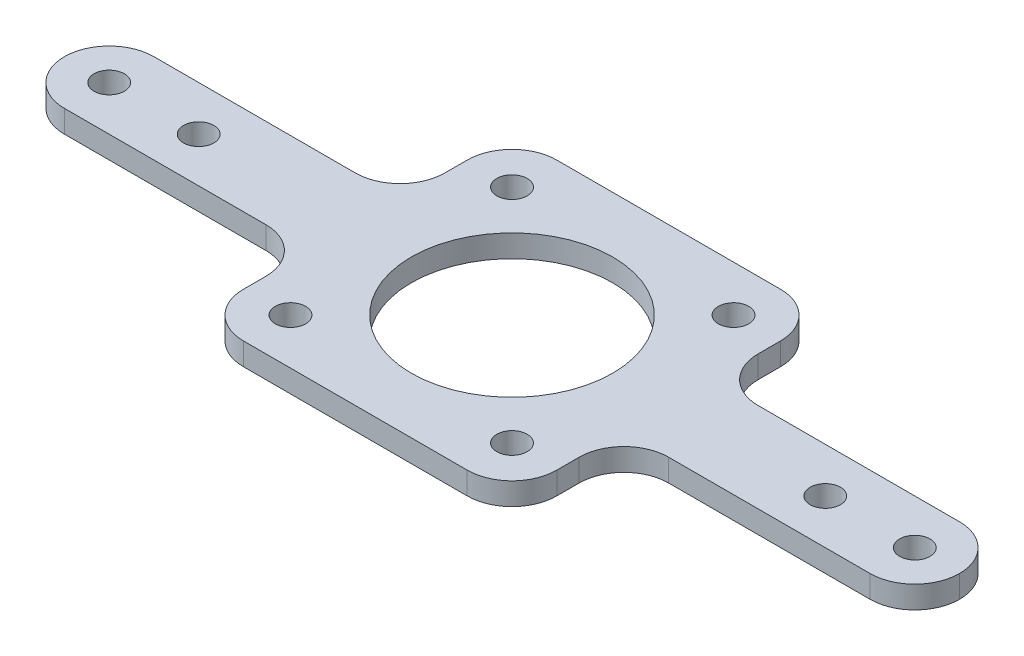
ISO-10303-21;
HEADER;
FILE_DESCRIPTION(('STEP AP214'),'2;1');
FILE_NAME('part.step','',(''),(''),'','','');
FILE_SCHEMA(('AUTOMOTIVE_DESIGN { 1 0 10303 214 1 1 1 1 }'));
ENDSEC;
DATA;
#1=APPLICATION_CONTEXT('core data for automotive mechanical design processes');
#2=APPLICATION_PROTOCOL_DEFINITION('international standard','automotive_design',2000,#1);
#3=PRODUCT_CONTEXT('',#1,'mechanical');
#4=PRODUCT('Part','Part','',(#3));
#5=PRODUCT_RELATED_PRODUCT_CATEGORY('part','',(#4));
#6=PRODUCT_DEFINITION_FORMATION('','',#4);
#7=PRODUCT_DEFINITION_CONTEXT('part definition',#1,'design');
#8=PRODUCT_DEFINITION('design','',#6,#7);
#9=PRODUCT_DEFINITION_SHAPE('','',#8);
#10=(LENGTH_UNIT() NAMED_UNIT(*) SI_UNIT(.MILLI.,.METRE.));
#11=(NAMED_UNIT(*) PLANE_ANGLE_UNIT() SI_UNIT($,.RADIAN.));
#12=(NAMED_UNIT(*) SI_UNIT($,.STERADIAN.) SOLID_ANGLE_UNIT());
#13=UNCERTAINTY_MEASURE_WITH_UNIT(LENGTH_MEASURE(1.E-05),#10,'distance_accuracy_value','');
#14=(GEOMETRIC_REPRESENTATION_CONTEXT(3) GLOBAL_UNCERTAINTY_ASSIGNED_CONTEXT((#13)) GLOBAL_UNIT_ASSIGNED_CONTEXT((#10,
#11,#12)) REPRESENTATION_CONTEXT('',''));
#15=CARTESIAN_POINT('',(0.,0.,0.));
#16=DIRECTION('',(0.,0.,1.));
#17=DIRECTION('',(1.,0.,0.));
#18=AXIS2_PLACEMENT_3D('',#15,#16,#17);
#19=CARTESIAN_POINT('',(22.225,3.175,0.));
#20=DIRECTION('',(-1.,0.,0.));
#21=DIRECTION('',(0.,0.,1.));
#22=AXIS2_PLACEMENT_3D('',#19,#20,#21);
#23=PLANE('',#22);
#24=DIRECTION('',(0.,0.,-1.));
#25=VECTOR('',#24,1.);
#26=CARTESIAN_POINT('',(22.225,3.175,0.));
#27=LINE('',#26,#25);
#28=CARTESIAN_POINT('',(22.225,3.175,15.875));
#29=VERTEX_POINT('',#28);
#30=CARTESIAN_POINT('',(22.225,3.175,12.7));
#31=VERTEX_POINT('',#30);
#32=EDGE_CURVE('E250',#29,#31,#27,.T.);
#33=ORIENTED_EDGE('',*,*,#32,.F.);
#34=DIRECTION('',(0.,-1.,0.));
#35=VECTOR('',#34,1.);
#36=CARTESIAN_POINT('',(22.225,3.175,15.875));
#37=LINE('',#36,#35);
#38=CARTESIAN_POINT('',(22.225,0.,15.875));
#39=VERTEX_POINT('',#38);
#40=EDGE_CURVE('E372',#29,#39,#37,.T.);
#41=ORIENTED_EDGE('',*,*,#40,.T.);
#42=DIRECTION('',(0.,0.,-1.));
#43=VECTOR('',#42,1.);
#44=CARTESIAN_POINT('',(22.225,0.,0.));
#45=LINE('',#44,#43);
#46=CARTESIAN_POINT('',(22.225,0.,12.7));
#47=VERTEX_POINT('',#46);
#48=EDGE_CURVE('E442',#39,#47,#45,.T.);
#49=ORIENTED_EDGE('',*,*,#48,.T.);
#50=DIRECTION('',(0.,-1.,0.));
#51=VECTOR('',#50,1.);
#52=CARTESIAN_POINT('',(22.225,3.175,12.7));
#53=LINE('',#52,#51);
#54=EDGE_CURVE('E258',#47,#31,#53,.F.);
#55=ORIENTED_EDGE('',*,*,#54,.T.);
#56=EDGE_LOOP('',(#33,#41,#49,#55));
#57=FACE_BOUND('',#56,.T.);
#58=ADVANCED_FACE('F41',(#57),#23,.F.);
#59=CARTESIAN_POINT('',(0.,3.175,6.35));
#60=DIRECTION('',(0.,0.,1.));
#61=DIRECTION('',(1.,0.,0.));
#62=AXIS2_PLACEMENT_3D('',#59,#60,#61);
#63=PLANE('',#62);
#64=DIRECTION('',(-1.,0.,0.));
#65=VECTOR('',#64,1.);
#66=CARTESIAN_POINT('',(0.,0.,6.35));
#67=LINE('',#66,#65);
#68=CARTESIAN_POINT('',(57.15,0.,6.34999999999999));
#69=VERTEX_POINT('',#68);
#70=CARTESIAN_POINT('',(28.575,0.,6.34999999999999));
#71=VERTEX_POINT('',#70);
#72=EDGE_CURVE('E231',#69,#71,#67,.T.);
#73=ORIENTED_EDGE('',*,*,#72,.F.);
#74=DIRECTION('',(0.,-1.,0.));
#75=VECTOR('',#74,1.);
#76=CARTESIAN_POINT('',(57.15,3.175,6.34999999999999));
#77=LINE('',#76,#75);
#78=CARTESIAN_POINT('',(57.15,3.175,6.34999999999999));
#79=VERTEX_POINT('',#78);
#80=EDGE_CURVE('E369',#69,#79,#77,.F.);
#81=ORIENTED_EDGE('',*,*,#80,.T.);
#82=DIRECTION('',(-1.,0.,0.));
#83=VECTOR('',#82,1.);
#84=CARTESIAN_POINT('',(0.,3.175,6.35));
#85=LINE('',#84,#83);
#86=CARTESIAN_POINT('',(28.575,3.175,6.34999999999999));
#87=VERTEX_POINT('',#86);
#88=EDGE_CURVE('E448',#79,#87,#85,.T.);
#89=ORIENTED_EDGE('',*,*,#88,.T.);
#90=DIRECTION('',(0.,-1.,0.));
#91=VECTOR('',#90,1.);
#92=CARTESIAN_POINT('',(28.575,3.175,6.34999999999999));
#93=LINE('',#92,#91);
#94=EDGE_CURVE('E254',#87,#71,#93,.T.);
#95=ORIENTED_EDGE('',*,*,#94,.T.);
#96=EDGE_LOOP('',(#73,#81,#89,#95));
#97=FACE_BOUND('',#96,.T.);
#98=ADVANCED_FACE('F490',(#97),#63,.T.);
#99=CARTESIAN_POINT('',(0.,3.175,-6.35));
#100=DIRECTION('',(0.,0.,1.));
#101=DIRECTION('',(1.,0.,0.));
#102=AXIS2_PLACEMENT_3D('',#99,#100,#101);
#103=PLANE('',#102);
#104=DIRECTION('',(-1.,0.,0.));
#105=VECTOR('',#104,1.);
#106=CARTESIAN_POINT('',(0.,3.175,-6.35));
#107=LINE('',#106,#105);
#108=CARTESIAN_POINT('',(57.15,3.175,-6.35000000000001));
#109=VERTEX_POINT('',#108);
#110=CARTESIAN_POINT('',(28.575,3.175,-6.35));
#111=VERTEX_POINT('',#110);
#112=EDGE_CURVE('E451',#109,#111,#107,.T.);
#113=ORIENTED_EDGE('',*,*,#112,.F.);
#114=DIRECTION('',(0.,-1.,0.));
#115=VECTOR('',#114,1.);
#116=CARTESIAN_POINT('',(57.15,3.175,-6.35000000000001));
#117=LINE('',#116,#115);
#118=CARTESIAN_POINT('',(57.15,0.,-6.35000000000001));
#119=VERTEX_POINT('',#118);
#120=EDGE_CURVE('E365',#109,#119,#117,.T.);
#121=ORIENTED_EDGE('',*,*,#120,.T.);
#122=DIRECTION('',(-1.,0.,0.));
#123=VECTOR('',#122,1.);
#124=CARTESIAN_POINT('',(0.,0.,-6.35));
#125=LINE('',#124,#123);
#126=CARTESIAN_POINT('',(28.575,0.,-6.35));
#127=VERTEX_POINT('',#126);
#128=EDGE_CURVE('E225',#119,#127,#125,.T.);
#129=ORIENTED_EDGE('',*,*,#128,.T.);
#130=DIRECTION('',(0.,-1.,0.));
#131=VECTOR('',#130,1.);
#132=CARTESIAN_POINT('',(28.575,3.175,-6.35));
#133=LINE('',#132,#131);
#134=EDGE_CURVE('E200',#127,#111,#133,.F.);
#135=ORIENTED_EDGE('',*,*,#134,.T.);
#136=EDGE_LOOP('',(#113,#121,#129,#135));
#137=FACE_BOUND('',#136,.T.);
#138=ADVANCED_FACE('F519',(#137),#103,.F.);
#139=CARTESIAN_POINT('',(22.225,3.175,0.));
#140=DIRECTION('',(-1.,0.,0.));
#141=DIRECTION('',(0.,0.,1.));
#142=AXIS2_PLACEMENT_3D('',#139,#140,#141);
#143=PLANE('',#142);
#144=DIRECTION('',(0.,0.,-1.));
#145=VECTOR('',#144,1.);
#146=CARTESIAN_POINT('',(22.225,0.,0.));
#147=LINE('',#146,#145);
#148=CARTESIAN_POINT('',(22.225,0.,-12.7));
#149=VERTEX_POINT('',#148);
#150=CARTESIAN_POINT('',(22.225,0.,-15.875));
#151=VERTEX_POINT('',#150);
#152=EDGE_CURVE('E212',#149,#151,#147,.T.);
#153=ORIENTED_EDGE('',*,*,#152,.T.);
#154=DIRECTION('',(0.,-1.,0.));
#155=VECTOR('',#154,1.);
#156=CARTESIAN_POINT('',(22.225,3.175,-15.875));
#157=LINE('',#156,#155);
#158=CARTESIAN_POINT('',(22.225,3.175,-15.875));
#159=VERTEX_POINT('',#158);
#160=EDGE_CURVE('E362',#151,#159,#157,.F.);
#161=ORIENTED_EDGE('',*,*,#160,.T.);
#162=DIRECTION('',(0.,0.,-1.));
#163=VECTOR('',#162,1.);
#164=CARTESIAN_POINT('',(22.225,3.175,0.));
#165=LINE('',#164,#163);
#166=CARTESIAN_POINT('',(22.225,3.175,-12.7));
#167=VERTEX_POINT('',#166);
#168=EDGE_CURVE('E215',#167,#159,#165,.T.);
#169=ORIENTED_EDGE('',*,*,#168,.F.);
#170=DIRECTION('',(0.,-1.,0.));
#171=VECTOR('',#170,1.);
#172=CARTESIAN_POINT('',(22.225,0.,-12.7));
#173=LINE('',#172,#171);
#174=EDGE_CURVE('E198',#167,#149,#173,.T.);
#175=ORIENTED_EDGE('',*,*,#174,.T.);
#176=EDGE_LOOP('',(#153,#161,#169,#175));
#177=FACE_BOUND('',#176,.T.);
#178=ADVANCED_FACE('F211',(#177),#143,.F.);
#179=CARTESIAN_POINT('',(0.,3.175,-22.225));
#180=DIRECTION('',(0.,0.,-1.));
#181=DIRECTION('',(-1.,0.,0.));
#182=AXIS2_PLACEMENT_3D('',#179,#180,#181);
#183=PLANE('',#182);
#184=DIRECTION('',(1.,0.,0.));
#185=VECTOR('',#184,1.);
#186=CARTESIAN_POINT('',(0.,0.,-22.225));
#187=LINE('',#186,#185);
#188=CARTESIAN_POINT('',(-15.875,0.,-22.225));
#189=VERTEX_POINT('',#188);
#190=CARTESIAN_POINT('',(15.875,0.,-22.225));
#191=VERTEX_POINT('',#190);
#192=EDGE_CURVE('E224',#189,#191,#187,.T.);
#193=ORIENTED_EDGE('',*,*,#192,.F.);
#194=DIRECTION('',(0.,-1.,0.));
#195=VECTOR('',#194,1.);
#196=CARTESIAN_POINT('',(-15.875,3.175,-22.225));
#197=LINE('',#196,#195);
#198=CARTESIAN_POINT('',(-15.875,3.175,-22.225));
#199=VERTEX_POINT('',#198);
#200=EDGE_CURVE('E359',#189,#199,#197,.F.);
#201=ORIENTED_EDGE('',*,*,#200,.T.);
#202=DIRECTION('',(1.,0.,0.));
#203=VECTOR('',#202,1.);
#204=CARTESIAN_POINT('',(0.,3.175,-22.225));
#205=LINE('',#204,#203);
#206=CARTESIAN_POINT('',(15.875,3.175,-22.225));
#207=VERTEX_POINT('',#206);
#208=EDGE_CURVE('E456',#199,#207,#205,.T.);
#209=ORIENTED_EDGE('',*,*,#208,.T.);
#210=DIRECTION('',(0.,-1.,0.));
#211=VECTOR('',#210,1.);
#212=CARTESIAN_POINT('',(15.875,0.,-22.225));
#213=LINE('',#212,#211);
#214=EDGE_CURVE('E355',#207,#191,#213,.T.);
#215=ORIENTED_EDGE('',*,*,#214,.T.);
#216=EDGE_LOOP('',(#193,#201,#209,#215));
#217=FACE_BOUND('',#216,.T.);
#218=ADVANCED_FACE('F562',(#217),#183,.T.);
#219=CARTESIAN_POINT('',(-22.225,3.175,0.));
#220=DIRECTION('',(-1.,0.,0.));
#221=DIRECTION('',(0.,0.,1.));
#222=AXIS2_PLACEMENT_3D('',#219,#220,#221);
#223=PLANE('',#222);
#224=DIRECTION('',(0.,0.,-1.));
#225=VECTOR('',#224,1.);
#226=CARTESIAN_POINT('',(-22.225,3.175,0.));
#227=LINE('',#226,#225);
#228=CARTESIAN_POINT('',(-22.225,3.175,-12.7));
#229=VERTEX_POINT('',#228);
#230=CARTESIAN_POINT('',(-22.225,3.175,-15.875));
#231=VERTEX_POINT('',#230);
#232=EDGE_CURVE('E460',#229,#231,#227,.T.);
#233=ORIENTED_EDGE('',*,*,#232,.T.);
#234=DIRECTION('',(0.,-1.,0.));
#235=VECTOR('',#234,1.);
#236=CARTESIAN_POINT('',(-22.225,3.175,-15.875));
#237=LINE('',#236,#235);
#238=CARTESIAN_POINT('',(-22.225,0.,-15.875));
#239=VERTEX_POINT('',#238);
#240=EDGE_CURVE('E351',#231,#239,#237,.T.);
#241=ORIENTED_EDGE('',*,*,#240,.T.);
#242=DIRECTION('',(0.,0.,-1.));
#243=VECTOR('',#242,1.);
#244=CARTESIAN_POINT('',(-22.225,0.,0.));
#245=LINE('',#244,#243);
#246=CARTESIAN_POINT('',(-22.225,0.,-12.7));
#247=VERTEX_POINT('',#246);
#248=EDGE_CURVE('E229',#247,#239,#245,.T.);
#249=ORIENTED_EDGE('',*,*,#248,.F.);
#250=DIRECTION('',(0.,-1.,0.));
#251=VECTOR('',#250,1.);
#252=CARTESIAN_POINT('',(-22.225,3.175,-12.7));
#253=LINE('',#252,#251);
#254=EDGE_CURVE('E206',#247,#229,#253,.F.);
#255=ORIENTED_EDGE('',*,*,#254,.T.);
#256=EDGE_LOOP('',(#233,#241,#249,#255));
#257=FACE_BOUND('',#256,.T.);
#258=ADVANCED_FACE('F568',(#257),#223,.T.);
#259=CARTESIAN_POINT('',(0.,3.175,-6.35));
#260=DIRECTION('',(0.,0.,1.));
#261=DIRECTION('',(1.,0.,0.));
#262=AXIS2_PLACEMENT_3D('',#259,#260,#261);
#263=PLANE('',#262);
#264=DIRECTION('',(-1.,0.,0.));
#265=VECTOR('',#264,1.);
#266=CARTESIAN_POINT('',(0.,0.,-6.35));
#267=LINE('',#266,#265);
#268=CARTESIAN_POINT('',(-28.575,0.,-6.35));
#269=VERTEX_POINT('',#268);
#270=CARTESIAN_POINT('',(-57.15,0.,-6.34999999999999));
#271=VERTEX_POINT('',#270);
#272=EDGE_CURVE('E238',#269,#271,#267,.T.);
#273=ORIENTED_EDGE('',*,*,#272,.T.);
#274=DIRECTION('',(0.,-1.,0.));
#275=VECTOR('',#274,1.);
#276=CARTESIAN_POINT('',(-57.15,3.175,-6.34999999999999));
#277=LINE('',#276,#275);
#278=CARTESIAN_POINT('',(-57.15,3.175,-6.34999999999999));
#279=VERTEX_POINT('',#278);
#280=EDGE_CURVE('E348',#271,#279,#277,.F.);
#281=ORIENTED_EDGE('',*,*,#280,.T.);
#282=DIRECTION('',(-1.,0.,0.));
#283=VECTOR('',#282,1.);
#284=CARTESIAN_POINT('',(0.,3.175,-6.35));
#285=LINE('',#284,#283);
#286=CARTESIAN_POINT('',(-28.575,3.175,-6.35));
#287=VERTEX_POINT('',#286);
#288=EDGE_CURVE('E464',#287,#279,#285,.T.);
#289=ORIENTED_EDGE('',*,*,#288,.F.);
#290=DIRECTION('',(0.,-1.,0.));
#291=VECTOR('',#290,1.);
#292=CARTESIAN_POINT('',(-28.575,3.175,-6.35));
#293=LINE('',#292,#291);
#294=EDGE_CURVE('E269',#287,#269,#293,.T.);
#295=ORIENTED_EDGE('',*,*,#294,.T.);
#296=EDGE_LOOP('',(#273,#281,#289,#295));
#297=FACE_BOUND('',#296,.T.);
#298=ADVANCED_FACE('F576',(#297),#263,.F.);
#299=CARTESIAN_POINT('',(0.,3.175,6.35));
#300=DIRECTION('',(0.,0.,1.));
#301=DIRECTION('',(1.,0.,0.));
#302=AXIS2_PLACEMENT_3D('',#299,#300,#301);
#303=PLANE('',#302);
#304=DIRECTION('',(-1.,0.,0.));
#305=VECTOR('',#304,1.);
#306=CARTESIAN_POINT('',(0.,3.175,6.35));
#307=LINE('',#306,#305);
#308=CARTESIAN_POINT('',(-28.575,3.175,6.35));
#309=VERTEX_POINT('',#308);
#310=CARTESIAN_POINT('',(-57.15,3.175,6.35));
#311=VERTEX_POINT('',#310);
#312=EDGE_CURVE('E468',#309,#311,#307,.T.);
#313=ORIENTED_EDGE('',*,*,#312,.T.);
#314=DIRECTION('',(0.,-1.,0.));
#315=VECTOR('',#314,1.);
#316=CARTESIAN_POINT('',(-57.15,3.175,6.35));
#317=LINE('',#316,#315);
#318=CARTESIAN_POINT('',(-57.15,0.,6.35));
#319=VERTEX_POINT('',#318);
#320=EDGE_CURVE('E298',#311,#319,#317,.T.);
#321=ORIENTED_EDGE('',*,*,#320,.T.);
#322=DIRECTION('',(-1.,0.,0.));
#323=VECTOR('',#322,1.);
#324=CARTESIAN_POINT('',(0.,0.,6.35));
#325=LINE('',#324,#323);
#326=CARTESIAN_POINT('',(-28.575,0.,6.35));
#327=VERTEX_POINT('',#326);
#328=EDGE_CURVE('E242',#327,#319,#325,.T.);
#329=ORIENTED_EDGE('',*,*,#328,.F.);
#330=DIRECTION('',(0.,-1.,0.));
#331=VECTOR('',#330,1.);
#332=CARTESIAN_POINT('',(-28.575,3.175,6.35));
#333=LINE('',#332,#331);
#334=EDGE_CURVE('E266',#327,#309,#333,.F.);
#335=ORIENTED_EDGE('',*,*,#334,.T.);
#336=EDGE_LOOP('',(#313,#321,#329,#335));
#337=FACE_BOUND('',#336,.T.);
#338=ADVANCED_FACE('F584',(#337),#303,.T.);
#339=CARTESIAN_POINT('',(-22.225,3.175,0.));
#340=DIRECTION('',(-1.,0.,0.));
#341=DIRECTION('',(0.,0.,1.));
#342=AXIS2_PLACEMENT_3D('',#339,#340,#341);
#343=PLANE('',#342);
#344=DIRECTION('',(0.,0.,-1.));
#345=VECTOR('',#344,1.);
#346=CARTESIAN_POINT('',(-22.225,0.,0.));
#347=LINE('',#346,#345);
#348=CARTESIAN_POINT('',(-22.225,0.,15.875));
#349=VERTEX_POINT('',#348);
#350=CARTESIAN_POINT('',(-22.225,0.,12.7));
#351=VERTEX_POINT('',#350);
#352=EDGE_CURVE('E245',#349,#351,#347,.T.);
#353=ORIENTED_EDGE('',*,*,#352,.F.);
#354=DIRECTION('',(0.,-1.,0.));
#355=VECTOR('',#354,1.);
#356=CARTESIAN_POINT('',(-22.225,3.175,15.875));
#357=LINE('',#356,#355);
#358=CARTESIAN_POINT('',(-22.225,3.175,15.875));
#359=VERTEX_POINT('',#358);
#360=EDGE_CURVE('E11',#349,#359,#357,.F.);
#361=ORIENTED_EDGE('',*,*,#360,.T.);
#362=DIRECTION('',(0.,0.,-1.));
#363=VECTOR('',#362,1.);
#364=CARTESIAN_POINT('',(-22.225,3.175,0.));
#365=LINE('',#364,#363);
#366=CARTESIAN_POINT('',(-22.225,3.175,12.7));
#367=VERTEX_POINT('',#366);
#368=EDGE_CURVE('E472',#359,#367,#365,.T.);
#369=ORIENTED_EDGE('',*,*,#368,.T.);
#370=DIRECTION('',(0.,-1.,0.));
#371=VECTOR('',#370,1.);
#372=CARTESIAN_POINT('',(-22.225,0.,12.7));
#373=LINE('',#372,#371);
#374=EDGE_CURVE('E262',#367,#351,#373,.T.);
#375=ORIENTED_EDGE('',*,*,#374,.T.);
#376=EDGE_LOOP('',(#353,#361,#369,#375));
#377=FACE_BOUND('',#376,.T.);
#378=ADVANCED_FACE('F592',(#377),#343,.T.);
#379=CARTESIAN_POINT('',(0.,3.175,22.225));
#380=DIRECTION('',(0.,0.,-1.));
#381=DIRECTION('',(-1.,0.,0.));
#382=AXIS2_PLACEMENT_3D('',#379,#380,#381);
#383=PLANE('',#382);
#384=DIRECTION('',(1.,0.,0.));
#385=VECTOR('',#384,1.);
#386=CARTESIAN_POINT('',(0.,0.,22.225));
#387=LINE('',#386,#385);
#388=CARTESIAN_POINT('',(-15.875,0.,22.225));
#389=VERTEX_POINT('',#388);
#390=CARTESIAN_POINT('',(15.875,0.,22.225));
#391=VERTEX_POINT('',#390);
#392=EDGE_CURVE('E248',#389,#391,#387,.T.);
#393=ORIENTED_EDGE('',*,*,#392,.T.);
#394=DIRECTION('',(0.,-1.,0.));
#395=VECTOR('',#394,1.);
#396=CARTESIAN_POINT('',(15.875,3.175,22.225));
#397=LINE('',#396,#395);
#398=CARTESIAN_POINT('',(15.875,3.175,22.225));
#399=VERTEX_POINT('',#398);
#400=EDGE_CURVE('E51',#391,#399,#397,.F.);
#401=ORIENTED_EDGE('',*,*,#400,.T.);
#402=DIRECTION('',(1.,0.,0.));
#403=VECTOR('',#402,1.);
#404=CARTESIAN_POINT('',(0.,3.175,22.225));
#405=LINE('',#404,#403);
#406=CARTESIAN_POINT('',(-15.875,3.175,22.225));
#407=VERTEX_POINT('',#406);
#408=EDGE_CURVE('E217',#407,#399,#405,.T.);
#409=ORIENTED_EDGE('',*,*,#408,.F.);
#410=DIRECTION('',(0.,-1.,0.));
#411=VECTOR('',#410,1.);
#412=CARTESIAN_POINT('',(-15.875,0.,22.225));
#413=LINE('',#412,#411);
#414=EDGE_CURVE('E376',#407,#389,#413,.T.);
#415=ORIENTED_EDGE('',*,*,#414,.T.);
#416=EDGE_LOOP('',(#393,#401,#409,#415));
#417=FACE_BOUND('',#416,.T.);
#418=ADVANCED_FACE('F500',(#417),#383,.F.);
#419=CARTESIAN_POINT('',(0.,3.175,0.));
#420=DIRECTION('',(0.,1.,0.));
#421=DIRECTION('',(0.,0.,1.));
#422=AXIS2_PLACEMENT_3D('',#419,#420,#421);
#423=PLANE('',#422);
#424=CARTESIAN_POINT('',(-44.45,3.175,0.));
#425=DIRECTION('',(0.,1.,0.));
#426=DIRECTION('',(0.,0.,1.));
#427=AXIS2_PLACEMENT_3D('',#424,#425,#426);
#428=CIRCLE('',#427,2.15264999999999);
#429=CARTESIAN_POINT('',(-44.45,3.175,2.15264999999999));
#430=VERTEX_POINT('',#429);
#431=EDGE_CURVE('E875',#430,#430,#428,.T.);
#432=ORIENTED_EDGE('',*,*,#431,.F.);
#433=EDGE_LOOP('',(#432));
#434=FACE_BOUND('',#433,.T.);
#435=CARTESIAN_POINT('',(-57.15,3.175,0.));
#436=DIRECTION('',(0.,1.,0.));
#437=DIRECTION('',(0.,0.,1.));
#438=AXIS2_PLACEMENT_3D('',#435,#436,#437);
#439=CIRCLE('',#438,2.15264999999999);
#440=CARTESIAN_POINT('',(-57.15,3.175,2.15264999999999));
#441=VERTEX_POINT('',#440);
#442=EDGE_CURVE('E879',#441,#441,#439,.T.);
#443=ORIENTED_EDGE('',*,*,#442,.F.);
#444=EDGE_LOOP('',(#443));
#445=FACE_BOUND('',#444,.T.);
#446=CARTESIAN_POINT('',(44.45,3.175,0.));
#447=DIRECTION('',(0.,1.,0.));
#448=DIRECTION('',(0.,0.,1.));
#449=AXIS2_PLACEMENT_3D('',#446,#447,#448);
#450=CIRCLE('',#449,2.15264999999999);
#451=CARTESIAN_POINT('',(44.45,3.175,2.15264999999999));
#452=VERTEX_POINT('',#451);
#453=EDGE_CURVE('E889',#452,#452,#450,.T.);
#454=ORIENTED_EDGE('',*,*,#453,.F.);
#455=EDGE_LOOP('',(#454));
#456=FACE_BOUND('',#455,.T.);
#457=CARTESIAN_POINT('',(57.15,3.175,0.));
#458=DIRECTION('',(0.,1.,0.));
#459=DIRECTION('',(0.,0.,1.));
#460=AXIS2_PLACEMENT_3D('',#457,#458,#459);
#461=CIRCLE('',#460,2.15264999999999);
#462=CARTESIAN_POINT('',(57.15,3.175,2.15264999999999));
#463=VERTEX_POINT('',#462);
#464=EDGE_CURVE('E400',#463,#463,#461,.T.);
#465=ORIENTED_EDGE('',*,*,#464,.F.);
#466=EDGE_LOOP('',(#465));
#467=FACE_BOUND('',#466,.T.);
#468=CARTESIAN_POINT('',(-15.7154482118712,3.175,-15.7154482118709));
#469=DIRECTION('',(0.,1.,0.));
#470=DIRECTION('',(0.,0.,1.));
#471=AXIS2_PLACEMENT_3D('',#468,#469,#470);
#472=CIRCLE('',#471,2.15264999999999);
#473=CARTESIAN_POINT('',(-15.7154482118712,3.175,-13.5627982118709));
#474=VERTEX_POINT('',#473);
#475=EDGE_CURVE('E384',#474,#474,#472,.T.);
#476=ORIENTED_EDGE('',*,*,#475,.F.);
#477=EDGE_LOOP('',(#476));
#478=FACE_BOUND('',#477,.T.);
#479=CARTESIAN_POINT('',(15.715448211871,3.175,-15.715448211871));
#480=DIRECTION('',(0.,1.,0.));
#481=DIRECTION('',(0.,0.,1.));
#482=AXIS2_PLACEMENT_3D('',#479,#480,#481);
#483=CIRCLE('',#482,2.15264999999999);
#484=CARTESIAN_POINT('',(15.715448211871,3.175,-13.562798211871));
#485=VERTEX_POINT('',#484);
#486=EDGE_CURVE('E413',#485,#485,#483,.T.);
#487=ORIENTED_EDGE('',*,*,#486,.F.);
#488=EDGE_LOOP('',(#487));
#489=FACE_BOUND('',#488,.T.);
#490=CARTESIAN_POINT('',(15.715448211871,3.175,15.715448211871));
#491=DIRECTION('',(0.,1.,0.));
#492=DIRECTION('',(0.,0.,1.));
#493=AXIS2_PLACEMENT_3D('',#490,#491,#492);
#494=CIRCLE('',#493,2.15264999999999);
#495=CARTESIAN_POINT('',(15.715448211871,3.175,17.868098211871));
#496=VERTEX_POINT('',#495);
#497=EDGE_CURVE('E421',#496,#496,#494,.T.);
#498=ORIENTED_EDGE('',*,*,#497,.F.);
#499=EDGE_LOOP('',(#498));
#500=FACE_BOUND('',#499,.T.);
#501=CARTESIAN_POINT('',(-15.715448211871,3.175,15.715448211871));
#502=DIRECTION('',(0.,1.,0.));
#503=DIRECTION('',(0.,0.,1.));
#504=AXIS2_PLACEMENT_3D('',#501,#502,#503);
#505=CIRCLE('',#504,2.15264999999999);
#506=CARTESIAN_POINT('',(-15.715448211871,3.175,17.868098211871));
#507=VERTEX_POINT('',#506);
#508=EDGE_CURVE('E429',#507,#507,#505,.T.);
#509=ORIENTED_EDGE('',*,*,#508,.F.);
#510=EDGE_LOOP('',(#509));
#511=FACE_BOUND('',#510,.T.);
#512=CARTESIAN_POINT('',(0.,3.175,0.));
#513=DIRECTION('',(0.,1.,0.));
#514=DIRECTION('',(0.,0.,1.));
#515=AXIS2_PLACEMENT_3D('',#512,#513,#514);
#516=CIRCLE('',#515,14.2875);
#517=CARTESIAN_POINT('',(0.,3.175,14.2875));
#518=VERTEX_POINT('',#517);
#519=EDGE_CURVE('E437',#518,#518,#516,.T.);
#520=ORIENTED_EDGE('',*,*,#519,.F.);
#521=EDGE_LOOP('',(#520));
#522=FACE_BOUND('',#521,.T.);
#523=CARTESIAN_POINT('',(-57.15,3.175,0.));
#524=DIRECTION('',(0.,1.,0.));
#525=DIRECTION('',(0.,0.,1.));
#526=AXIS2_PLACEMENT_3D('',#523,#524,#525);
#527=CIRCLE('',#526,6.35);
#528=CARTESIAN_POINT('',(-63.5,3.175,0.));
#529=VERTEX_POINT('',#528);
#530=EDGE_CURVE('E342',#279,#529,#527,.T.);
#531=ORIENTED_EDGE('',*,*,#530,.T.);
#532=CARTESIAN_POINT('',(-57.15,3.175,0.));
#533=DIRECTION('',(0.,1.,0.));
#534=DIRECTION('',(0.,0.,1.));
#535=AXIS2_PLACEMENT_3D('',#532,#533,#534);
#536=CIRCLE('',#535,6.35);
#537=EDGE_CURVE('E345',#529,#311,#536,.T.);
#538=ORIENTED_EDGE('',*,*,#537,.T.);
#539=ORIENTED_EDGE('',*,*,#312,.F.);
#540=CARTESIAN_POINT('',(-28.575,3.175,12.7));
#541=DIRECTION('',(0.,1.,0.));
#542=DIRECTION('',(0.,0.,1.));
#543=AXIS2_PLACEMENT_3D('',#540,#541,#542);
#544=CIRCLE('',#543,6.35);
#545=EDGE_CURVE('E288',#309,#367,#544,.F.);
#546=ORIENTED_EDGE('',*,*,#545,.T.);
#547=ORIENTED_EDGE('',*,*,#368,.F.);
#548=CARTESIAN_POINT('',(-15.875,3.175,15.875));
#549=DIRECTION('',(0.,1.,0.));
#550=DIRECTION('',(0.,0.,1.));
#551=AXIS2_PLACEMENT_3D('',#548,#549,#550);
#552=CIRCLE('',#551,6.35);
#553=EDGE_CURVE('E65',#359,#407,#552,.T.);
#554=ORIENTED_EDGE('',*,*,#553,.T.);
#555=ORIENTED_EDGE('',*,*,#408,.T.);
#556=CARTESIAN_POINT('',(15.875,3.175,15.875));
#557=DIRECTION('',(0.,1.,0.));
#558=DIRECTION('',(0.,0.,1.));
#559=AXIS2_PLACEMENT_3D('',#556,#557,#558);
#560=CIRCLE('',#559,6.35);
#561=EDGE_CURVE('E327',#399,#29,#560,.T.);
#562=ORIENTED_EDGE('',*,*,#561,.T.);
#563=ORIENTED_EDGE('',*,*,#32,.T.);
#564=CARTESIAN_POINT('',(28.575,3.175,12.7));
#565=DIRECTION('',(0.,1.,0.));
#566=DIRECTION('',(0.,0.,1.));
#567=AXIS2_PLACEMENT_3D('',#564,#565,#566);
#568=CIRCLE('',#567,6.35);
#569=EDGE_CURVE('E281',#31,#87,#568,.F.);
#570=ORIENTED_EDGE('',*,*,#569,.T.);
#571=ORIENTED_EDGE('',*,*,#88,.F.);
#572=CARTESIAN_POINT('',(57.15,3.175,0.));
#573=DIRECTION('',(0.,1.,0.));
#574=DIRECTION('',(0.,0.,1.));
#575=AXIS2_PLACEMENT_3D('',#572,#573,#574);
#576=CIRCLE('',#575,6.35);
#577=CARTESIAN_POINT('',(63.5,3.175,0.));
#578=VERTEX_POINT('',#577);
#579=EDGE_CURVE('E330',#79,#578,#576,.T.);
#580=ORIENTED_EDGE('',*,*,#579,.T.);
#581=CARTESIAN_POINT('',(57.15,3.175,0.));
#582=DIRECTION('',(0.,1.,0.));
#583=DIRECTION('',(0.,0.,1.));
#584=AXIS2_PLACEMENT_3D('',#581,#582,#583);
#585=CIRCLE('',#584,6.35);
#586=EDGE_CURVE('E333',#578,#109,#585,.T.);
#587=ORIENTED_EDGE('',*,*,#586,.T.);
#588=ORIENTED_EDGE('',*,*,#112,.T.);
#589=CARTESIAN_POINT('',(28.575,3.175,-12.7));
#590=DIRECTION('',(0.,1.,0.));
#591=DIRECTION('',(0.,0.,1.));
#592=AXIS2_PLACEMENT_3D('',#589,#590,#591);
#593=CIRCLE('',#592,6.35);
#594=EDGE_CURVE('E205',#111,#167,#593,.F.);
#595=ORIENTED_EDGE('',*,*,#594,.T.);
#596=ORIENTED_EDGE('',*,*,#168,.T.);
#597=CARTESIAN_POINT('',(15.875,3.175,-15.875));
#598=DIRECTION('',(0.,1.,0.));
#599=DIRECTION('',(0.,0.,1.));
#600=AXIS2_PLACEMENT_3D('',#597,#598,#599);
#601=CIRCLE('',#600,6.35);
#602=EDGE_CURVE('E336',#159,#207,#601,.T.);
#603=ORIENTED_EDGE('',*,*,#602,.T.);
#604=ORIENTED_EDGE('',*,*,#208,.F.);
#605=CARTESIAN_POINT('',(-15.875,3.175,-15.875));
#606=DIRECTION('',(0.,1.,0.));
#607=DIRECTION('',(0.,0.,1.));
#608=AXIS2_PLACEMENT_3D('',#605,#606,#607);
#609=CIRCLE('',#608,6.35);
#610=EDGE_CURVE('E339',#199,#231,#609,.T.);
#611=ORIENTED_EDGE('',*,*,#610,.T.);
#612=ORIENTED_EDGE('',*,*,#232,.F.);
#613=CARTESIAN_POINT('',(-28.575,3.175,-12.7));
#614=DIRECTION('',(0.,1.,0.));
#615=DIRECTION('',(0.,0.,1.));
#616=AXIS2_PLACEMENT_3D('',#613,#614,#615);
#617=CIRCLE('',#616,6.35);
#618=EDGE_CURVE('E295',#229,#287,#617,.F.);
#619=ORIENTED_EDGE('',*,*,#618,.T.);
#620=ORIENTED_EDGE('',*,*,#288,.T.);
#621=EDGE_LOOP('',(#531,#538,#539,#546,#547,#554,#555,#562,#563,#570,#571,#580,#587,#588,#595,
#596,#603,#604,#611,#612,#619,#620));
#622=FACE_BOUND('',#621,.T.);
#623=ADVANCED_FACE('F493',(#434,#445,#456,#467,#478,#489,#500,#511,#522,#622),#423,.T.);
#624=CARTESIAN_POINT('',(0.,0.,0.));
#625=DIRECTION('',(0.,1.,0.));
#626=DIRECTION('',(0.,0.,1.));
#627=AXIS2_PLACEMENT_3D('',#624,#625,#626);
#628=PLANE('',#627);
#629=CARTESIAN_POINT('',(-44.45,0.,0.));
#630=DIRECTION('',(0.,1.,0.));
#631=DIRECTION('',(0.,0.,1.));
#632=AXIS2_PLACEMENT_3D('',#629,#630,#631);
#633=CIRCLE('',#632,2.15265);
#634=CARTESIAN_POINT('',(-44.45,0.,2.15265));
#635=VERTEX_POINT('',#634);
#636=EDGE_CURVE('E872',#635,#635,#633,.T.);
#637=ORIENTED_EDGE('',*,*,#636,.T.);
#638=EDGE_LOOP('',(#637));
#639=FACE_BOUND('',#638,.T.);
#640=CARTESIAN_POINT('',(-57.15,0.,0.));
#641=DIRECTION('',(0.,1.,0.));
#642=DIRECTION('',(0.,0.,1.));
#643=AXIS2_PLACEMENT_3D('',#640,#641,#642);
#644=CIRCLE('',#643,2.15265);
#645=CARTESIAN_POINT('',(-57.15,0.,2.15265));
#646=VERTEX_POINT('',#645);
#647=EDGE_CURVE('E885',#646,#646,#644,.T.);
#648=ORIENTED_EDGE('',*,*,#647,.T.);
#649=EDGE_LOOP('',(#648));
#650=FACE_BOUND('',#649,.T.);
#651=CARTESIAN_POINT('',(44.45,0.,0.));
#652=DIRECTION('',(0.,1.,0.));
#653=DIRECTION('',(0.,0.,1.));
#654=AXIS2_PLACEMENT_3D('',#651,#652,#653);
#655=CIRCLE('',#654,2.15265);
#656=CARTESIAN_POINT('',(44.45,0.,2.15265));
#657=VERTEX_POINT('',#656);
#658=EDGE_CURVE('E406',#657,#657,#655,.T.);
#659=ORIENTED_EDGE('',*,*,#658,.T.);
#660=EDGE_LOOP('',(#659));
#661=FACE_BOUND('',#660,.T.);
#662=CARTESIAN_POINT('',(57.15,0.,0.));
#663=DIRECTION('',(0.,1.,0.));
#664=DIRECTION('',(0.,0.,1.));
#665=AXIS2_PLACEMENT_3D('',#662,#663,#664);
#666=CIRCLE('',#665,2.15265);
#667=CARTESIAN_POINT('',(57.15,0.,2.15265));
#668=VERTEX_POINT('',#667);
#669=EDGE_CURVE('E394',#668,#668,#666,.T.);
#670=ORIENTED_EDGE('',*,*,#669,.T.);
#671=EDGE_LOOP('',(#670));
#672=FACE_BOUND('',#671,.T.);
#673=CARTESIAN_POINT('',(-15.7154482118712,0.,-15.7154482118709));
#674=DIRECTION('',(0.,1.,0.));
#675=DIRECTION('',(0.,0.,1.));
#676=AXIS2_PLACEMENT_3D('',#673,#674,#675);
#677=CIRCLE('',#676,2.15265);
#678=CARTESIAN_POINT('',(-15.7154482118712,0.,-13.5627982118709));
#679=VERTEX_POINT('',#678);
#680=EDGE_CURVE('E391',#679,#679,#677,.T.);
#681=ORIENTED_EDGE('',*,*,#680,.T.);
#682=EDGE_LOOP('',(#681));
#683=FACE_BOUND('',#682,.T.);
#684=CARTESIAN_POINT('',(15.715448211871,0.,-15.715448211871));
#685=DIRECTION('',(0.,1.,0.));
#686=DIRECTION('',(0.,0.,1.));
#687=AXIS2_PLACEMENT_3D('',#684,#685,#686);
#688=CIRCLE('',#687,2.15265);
#689=CARTESIAN_POINT('',(15.715448211871,0.,-13.562798211871));
#690=VERTEX_POINT('',#689);
#691=EDGE_CURVE('E417',#690,#690,#688,.T.);
#692=ORIENTED_EDGE('',*,*,#691,.T.);
#693=EDGE_LOOP('',(#692));
#694=FACE_BOUND('',#693,.T.);
#695=CARTESIAN_POINT('',(15.715448211871,0.,15.715448211871));
#696=DIRECTION('',(0.,1.,0.));
#697=DIRECTION('',(0.,0.,1.));
#698=AXIS2_PLACEMENT_3D('',#695,#696,#697);
#699=CIRCLE('',#698,2.15265);
#700=CARTESIAN_POINT('',(15.715448211871,0.,17.868098211871));
#701=VERTEX_POINT('',#700);
#702=EDGE_CURVE('E425',#701,#701,#699,.T.);
#703=ORIENTED_EDGE('',*,*,#702,.T.);
#704=EDGE_LOOP('',(#703));
#705=FACE_BOUND('',#704,.T.);
#706=CARTESIAN_POINT('',(-15.715448211871,0.,15.715448211871));
#707=DIRECTION('',(0.,1.,0.));
#708=DIRECTION('',(0.,0.,1.));
#709=AXIS2_PLACEMENT_3D('',#706,#707,#708);
#710=CIRCLE('',#709,2.15265);
#711=CARTESIAN_POINT('',(-15.715448211871,0.,17.868098211871));
#712=VERTEX_POINT('',#711);
#713=EDGE_CURVE('E433',#712,#712,#710,.T.);
#714=ORIENTED_EDGE('',*,*,#713,.T.);
#715=EDGE_LOOP('',(#714));
#716=FACE_BOUND('',#715,.T.);
#717=CARTESIAN_POINT('',(0.,0.,0.));
#718=DIRECTION('',(0.,1.,0.));
#719=DIRECTION('',(0.,0.,1.));
#720=AXIS2_PLACEMENT_3D('',#717,#718,#719);
#721=CIRCLE('',#720,14.2875);
#722=CARTESIAN_POINT('',(0.,0.,14.2875));
#723=VERTEX_POINT('',#722);
#724=EDGE_CURVE('E438',#723,#723,#721,.T.);
#725=ORIENTED_EDGE('',*,*,#724,.T.);
#726=EDGE_LOOP('',(#725));
#727=FACE_BOUND('',#726,.T.);
#728=ORIENTED_EDGE('',*,*,#328,.T.);
#729=CARTESIAN_POINT('',(-57.15,0.,0.));
#730=DIRECTION('',(0.,1.,0.));
#731=DIRECTION('',(0.,0.,1.));
#732=AXIS2_PLACEMENT_3D('',#729,#730,#731);
#733=CIRCLE('',#732,6.35);
#734=CARTESIAN_POINT('',(-63.5,0.,0.));
#735=VERTEX_POINT('',#734);
#736=EDGE_CURVE('E322',#319,#735,#733,.F.);
#737=ORIENTED_EDGE('',*,*,#736,.T.);
#738=CARTESIAN_POINT('',(-57.15,0.,0.));
#739=DIRECTION('',(0.,1.,0.));
#740=DIRECTION('',(0.,0.,1.));
#741=AXIS2_PLACEMENT_3D('',#738,#739,#740);
#742=CIRCLE('',#741,6.35);
#743=EDGE_CURVE('E319',#735,#271,#742,.F.);
#744=ORIENTED_EDGE('',*,*,#743,.T.);
#745=ORIENTED_EDGE('',*,*,#272,.F.);
#746=CARTESIAN_POINT('',(-28.575,0.,-12.7));
#747=DIRECTION('',(0.,1.,0.));
#748=DIRECTION('',(0.,0.,1.));
#749=AXIS2_PLACEMENT_3D('',#746,#747,#748);
#750=CIRCLE('',#749,6.35);
#751=EDGE_CURVE('E292',#269,#247,#750,.T.);
#752=ORIENTED_EDGE('',*,*,#751,.T.);
#753=ORIENTED_EDGE('',*,*,#248,.T.);
#754=CARTESIAN_POINT('',(-15.875,0.,-15.875));
#755=DIRECTION('',(0.,1.,0.));
#756=DIRECTION('',(0.,0.,1.));
#757=AXIS2_PLACEMENT_3D('',#754,#755,#756);
#758=CIRCLE('',#757,6.35);
#759=EDGE_CURVE('E316',#239,#189,#758,.F.);
#760=ORIENTED_EDGE('',*,*,#759,.T.);
#761=ORIENTED_EDGE('',*,*,#192,.T.);
#762=CARTESIAN_POINT('',(15.875,0.,-15.875));
#763=DIRECTION('',(0.,1.,0.));
#764=DIRECTION('',(0.,0.,1.));
#765=AXIS2_PLACEMENT_3D('',#762,#763,#764);
#766=CIRCLE('',#765,6.35);
#767=EDGE_CURVE('E222',#191,#151,#766,.F.);
#768=ORIENTED_EDGE('',*,*,#767,.T.);
#769=ORIENTED_EDGE('',*,*,#152,.F.);
#770=CARTESIAN_POINT('',(28.575,0.,-12.7));
#771=DIRECTION('',(0.,1.,0.));
#772=DIRECTION('',(0.,0.,1.));
#773=AXIS2_PLACEMENT_3D('',#770,#771,#772);
#774=CIRCLE('',#773,6.35);
#775=EDGE_CURVE('E194',#149,#127,#774,.T.);
#776=ORIENTED_EDGE('',*,*,#775,.T.);
#777=ORIENTED_EDGE('',*,*,#128,.F.);
#778=CARTESIAN_POINT('',(57.15,0.,0.));
#779=DIRECTION('',(0.,1.,0.));
#780=DIRECTION('',(0.,0.,1.));
#781=AXIS2_PLACEMENT_3D('',#778,#779,#780);
#782=CIRCLE('',#781,6.35);
#783=CARTESIAN_POINT('',(63.5,0.,0.));
#784=VERTEX_POINT('',#783);
#785=EDGE_CURVE('E311',#119,#784,#782,.F.);
#786=ORIENTED_EDGE('',*,*,#785,.T.);
#787=CARTESIAN_POINT('',(57.15,0.,0.));
#788=DIRECTION('',(0.,1.,0.));
#789=DIRECTION('',(0.,0.,1.));
#790=AXIS2_PLACEMENT_3D('',#787,#788,#789);
#791=CIRCLE('',#790,6.35);
#792=EDGE_CURVE('E308',#784,#69,#791,.F.);
#793=ORIENTED_EDGE('',*,*,#792,.T.);
#794=ORIENTED_EDGE('',*,*,#72,.T.);
#795=CARTESIAN_POINT('',(28.575,0.,12.7));
#796=DIRECTION('',(0.,1.,0.));
#797=DIRECTION('',(0.,0.,1.));
#798=AXIS2_PLACEMENT_3D('',#795,#796,#797);
#799=CIRCLE('',#798,6.35);
#800=EDGE_CURVE('E277',#71,#47,#799,.T.);
#801=ORIENTED_EDGE('',*,*,#800,.T.);
#802=ORIENTED_EDGE('',*,*,#48,.F.);
#803=CARTESIAN_POINT('',(15.875,0.,15.875));
#804=DIRECTION('',(0.,1.,0.));
#805=DIRECTION('',(0.,0.,1.));
#806=AXIS2_PLACEMENT_3D('',#803,#804,#805);
#807=CIRCLE('',#806,6.35);
#808=EDGE_CURVE('E305',#39,#391,#807,.F.);
#809=ORIENTED_EDGE('',*,*,#808,.T.);
#810=ORIENTED_EDGE('',*,*,#392,.F.);
#811=CARTESIAN_POINT('',(-15.875,0.,15.875));
#812=DIRECTION('',(0.,1.,0.));
#813=DIRECTION('',(0.,0.,1.));
#814=AXIS2_PLACEMENT_3D('',#811,#812,#813);
#815=CIRCLE('',#814,6.35);
#816=EDGE_CURVE('E302',#389,#349,#815,.F.);
#817=ORIENTED_EDGE('',*,*,#816,.T.);
#818=ORIENTED_EDGE('',*,*,#352,.T.);
#819=CARTESIAN_POINT('',(-28.575,0.,12.7));
#820=DIRECTION('',(0.,1.,0.));
#821=DIRECTION('',(0.,0.,1.));
#822=AXIS2_PLACEMENT_3D('',#819,#820,#821);
#823=CIRCLE('',#822,6.35);
#824=EDGE_CURVE('E285',#351,#327,#823,.T.);
#825=ORIENTED_EDGE('',*,*,#824,.T.);
#826=EDGE_LOOP('',(#728,#737,#744,#745,#752,#753,#760,#761,#768,#769,#776,#777,#786,#793,#794,
#801,#802,#809,#810,#817,#818,#825));
#827=FACE_BOUND('',#826,.T.);
#828=ADVANCED_FACE('F220',(#639,#650,#661,#672,#683,#694,#705,#716,#727,#827),#628,.F.);
#829=CARTESIAN_POINT('',(0.,0.,0.));
#830=DIRECTION('',(0.,1.,0.));
#831=DIRECTION('',(0.,0.,1.));
#832=AXIS2_PLACEMENT_3D('',#829,#830,#831);
#833=CYLINDRICAL_SURFACE('',#832,14.2875);
#834=ORIENTED_EDGE('',*,*,#724,.F.);
#835=EDGE_LOOP('',(#834));
#836=FACE_BOUND('',#835,.T.);
#837=ORIENTED_EDGE('',*,*,#519,.T.);
#838=EDGE_LOOP('',(#837));
#839=FACE_BOUND('',#838,.T.);
#840=ADVANCED_FACE('F733',(#836,#839),#833,.F.);
#841=CARTESIAN_POINT('',(-15.715448211871,3.175,15.715448211871));
#842=DIRECTION('',(0.,1.,0.));
#843=DIRECTION('',(0.,0.,1.));
#844=AXIS2_PLACEMENT_3D('',#841,#842,#843);
#845=CYLINDRICAL_SURFACE('',#844,2.15264999999999);
#846=ORIENTED_EDGE('',*,*,#713,.F.);
#847=EDGE_LOOP('',(#846));
#848=FACE_BOUND('',#847,.T.);
#849=ORIENTED_EDGE('',*,*,#508,.T.);
#850=EDGE_LOOP('',(#849));
#851=FACE_BOUND('',#850,.T.);
#852=ADVANCED_FACE('F770',(#848,#851),#845,.F.);
#853=CARTESIAN_POINT('',(15.715448211871,3.175,15.715448211871));
#854=DIRECTION('',(0.,1.,0.));
#855=DIRECTION('',(0.,0.,1.));
#856=AXIS2_PLACEMENT_3D('',#853,#854,#855);
#857=CYLINDRICAL_SURFACE('',#856,2.15264999999999);
#858=ORIENTED_EDGE('',*,*,#702,.F.);
#859=EDGE_LOOP('',(#858));
#860=FACE_BOUND('',#859,.T.);
#861=ORIENTED_EDGE('',*,*,#497,.T.);
#862=EDGE_LOOP('',(#861));
#863=FACE_BOUND('',#862,.T.);
#864=ADVANCED_FACE('F766',(#860,#863),#857,.F.);
#865=CARTESIAN_POINT('',(15.715448211871,3.175,-15.715448211871));
#866=DIRECTION('',(0.,1.,0.));
#867=DIRECTION('',(0.,0.,1.));
#868=AXIS2_PLACEMENT_3D('',#865,#866,#867);
#869=CYLINDRICAL_SURFACE('',#868,2.15264999999999);
#870=ORIENTED_EDGE('',*,*,#691,.F.);
#871=EDGE_LOOP('',(#870));
#872=FACE_BOUND('',#871,.T.);
#873=ORIENTED_EDGE('',*,*,#486,.T.);
#874=EDGE_LOOP('',(#873));
#875=FACE_BOUND('',#874,.T.);
#876=ADVANCED_FACE('F762',(#872,#875),#869,.F.);
#877=CARTESIAN_POINT('',(-15.7154482118712,3.175,-15.7154482118709));
#878=DIRECTION('',(0.,1.,0.));
#879=DIRECTION('',(0.,0.,1.));
#880=AXIS2_PLACEMENT_3D('',#877,#878,#879);
#881=CYLINDRICAL_SURFACE('',#880,2.15264999999999);
#882=ORIENTED_EDGE('',*,*,#680,.F.);
#883=EDGE_LOOP('',(#882));
#884=FACE_BOUND('',#883,.T.);
#885=ORIENTED_EDGE('',*,*,#475,.T.);
#886=EDGE_LOOP('',(#885));
#887=FACE_BOUND('',#886,.T.);
#888=ADVANCED_FACE('F525',(#884,#887),#881,.F.);
#889=CARTESIAN_POINT('',(28.575,3.175,-12.7));
#890=DIRECTION('',(0.,1.,0.));
#891=DIRECTION('',(0.,0.,1.));
#892=AXIS2_PLACEMENT_3D('',#889,#890,#891);
#893=CYLINDRICAL_SURFACE('',#892,6.35);
#894=ORIENTED_EDGE('',*,*,#594,.F.);
#895=ORIENTED_EDGE('',*,*,#134,.F.);
#896=ORIENTED_EDGE('',*,*,#775,.F.);
#897=ORIENTED_EDGE('',*,*,#174,.F.);
#898=EDGE_LOOP('',(#894,#895,#896,#897));
#899=FACE_BOUND('',#898,.T.);
#900=ADVANCED_FACE('F197',(#899),#893,.F.);
#901=CARTESIAN_POINT('',(28.575,3.175,12.7));
#902=DIRECTION('',(0.,-1.,0.));
#903=DIRECTION('',(0.,0.,-1.));
#904=AXIS2_PLACEMENT_3D('',#901,#902,#903);
#905=CYLINDRICAL_SURFACE('',#904,6.35);
#906=ORIENTED_EDGE('',*,*,#569,.F.);
#907=ORIENTED_EDGE('',*,*,#54,.F.);
#908=ORIENTED_EDGE('',*,*,#800,.F.);
#909=ORIENTED_EDGE('',*,*,#94,.F.);
#910=EDGE_LOOP('',(#906,#907,#908,#909));
#911=FACE_BOUND('',#910,.T.);
#912=ADVANCED_FACE('F489',(#911),#905,.F.);
#913=CARTESIAN_POINT('',(-28.575,3.175,12.7));
#914=DIRECTION('',(0.,1.,0.));
#915=DIRECTION('',(0.,0.,1.));
#916=AXIS2_PLACEMENT_3D('',#913,#914,#915);
#917=CYLINDRICAL_SURFACE('',#916,6.35);
#918=ORIENTED_EDGE('',*,*,#545,.F.);
#919=ORIENTED_EDGE('',*,*,#334,.F.);
#920=ORIENTED_EDGE('',*,*,#824,.F.);
#921=ORIENTED_EDGE('',*,*,#374,.F.);
#922=EDGE_LOOP('',(#918,#919,#920,#921));
#923=FACE_BOUND('',#922,.T.);
#924=ADVANCED_FACE('F528',(#923),#917,.F.);
#925=CARTESIAN_POINT('',(-28.575,3.175,-12.7));
#926=DIRECTION('',(0.,-1.,0.));
#927=DIRECTION('',(0.,0.,-1.));
#928=AXIS2_PLACEMENT_3D('',#925,#926,#927);
#929=CYLINDRICAL_SURFACE('',#928,6.35);
#930=ORIENTED_EDGE('',*,*,#618,.F.);
#931=ORIENTED_EDGE('',*,*,#254,.F.);
#932=ORIENTED_EDGE('',*,*,#751,.F.);
#933=ORIENTED_EDGE('',*,*,#294,.F.);
#934=EDGE_LOOP('',(#930,#931,#932,#933));
#935=FACE_BOUND('',#934,.T.);
#936=ADVANCED_FACE('F531',(#935),#929,.F.);
#937=CARTESIAN_POINT('',(-57.15,3.175,0.));
#938=DIRECTION('',(0.,1.,0.));
#939=DIRECTION('',(0.,0.,1.));
#940=AXIS2_PLACEMENT_3D('',#937,#938,#939);
#941=CYLINDRICAL_SURFACE('',#940,6.35);
#942=DIRECTION('',(0.,-1.,0.));
#943=VECTOR('',#942,1.);
#944=CARTESIAN_POINT('',(-63.5,0.,0.));
#945=LINE('',#944,#943);
#946=EDGE_CURVE('E381',#529,#735,#945,.T.);
#947=ORIENTED_EDGE('',*,*,#946,.F.);
#948=ORIENTED_EDGE('',*,*,#530,.F.);
#949=ORIENTED_EDGE('',*,*,#280,.F.);
#950=ORIENTED_EDGE('',*,*,#743,.F.);
#951=EDGE_LOOP('',(#947,#948,#949,#950));
#952=FACE_BOUND('',#951,.T.);
#953=ADVANCED_FACE('F535',(#952),#941,.T.);
#954=CARTESIAN_POINT('',(-57.15,3.175,0.));
#955=DIRECTION('',(0.,-1.,0.));
#956=DIRECTION('',(0.,0.,-1.));
#957=AXIS2_PLACEMENT_3D('',#954,#955,#956);
#958=CYLINDRICAL_SURFACE('',#957,6.35);
#959=ORIENTED_EDGE('',*,*,#537,.F.);
#960=ORIENTED_EDGE('',*,*,#946,.T.);
#961=ORIENTED_EDGE('',*,*,#736,.F.);
#962=ORIENTED_EDGE('',*,*,#320,.F.);
#963=EDGE_LOOP('',(#959,#960,#961,#962));
#964=FACE_BOUND('',#963,.T.);
#965=ADVANCED_FACE('F537',(#964),#958,.T.);
#966=CARTESIAN_POINT('',(-15.875,3.175,-15.875));
#967=DIRECTION('',(0.,-1.,0.));
#968=DIRECTION('',(0.,0.,-1.));
#969=AXIS2_PLACEMENT_3D('',#966,#967,#968);
#970=CYLINDRICAL_SURFACE('',#969,6.35);
#971=ORIENTED_EDGE('',*,*,#610,.F.);
#972=ORIENTED_EDGE('',*,*,#200,.F.);
#973=ORIENTED_EDGE('',*,*,#759,.F.);
#974=ORIENTED_EDGE('',*,*,#240,.F.);
#975=EDGE_LOOP('',(#971,#972,#973,#974));
#976=FACE_BOUND('',#975,.T.);
#977=ADVANCED_FACE('F540',(#976),#970,.T.);
#978=CARTESIAN_POINT('',(15.875,3.175,-15.875));
#979=DIRECTION('',(0.,1.,0.));
#980=DIRECTION('',(0.,0.,1.));
#981=AXIS2_PLACEMENT_3D('',#978,#979,#980);
#982=CYLINDRICAL_SURFACE('',#981,6.35);
#983=ORIENTED_EDGE('',*,*,#602,.F.);
#984=ORIENTED_EDGE('',*,*,#160,.F.);
#985=ORIENTED_EDGE('',*,*,#767,.F.);
#986=ORIENTED_EDGE('',*,*,#214,.F.);
#987=EDGE_LOOP('',(#983,#984,#985,#986));
#988=FACE_BOUND('',#987,.T.);
#989=ADVANCED_FACE('F546',(#988),#982,.T.);
#990=CARTESIAN_POINT('',(57.15,3.175,0.));
#991=DIRECTION('',(0.,1.,0.));
#992=DIRECTION('',(0.,0.,1.));
#993=AXIS2_PLACEMENT_3D('',#990,#991,#992);
#994=CYLINDRICAL_SURFACE('',#993,6.35);
#995=DIRECTION('',(0.,-1.,0.));
#996=VECTOR('',#995,1.);
#997=CARTESIAN_POINT('',(63.5,0.,0.));
#998=LINE('',#997,#996);
#999=EDGE_CURVE('E45',#578,#784,#998,.T.);
#1000=ORIENTED_EDGE('',*,*,#999,.F.);
#1001=ORIENTED_EDGE('',*,*,#579,.F.);
#1002=ORIENTED_EDGE('',*,*,#80,.F.);
#1003=ORIENTED_EDGE('',*,*,#792,.F.);
#1004=EDGE_LOOP('',(#1000,#1001,#1002,#1003));
#1005=FACE_BOUND('',#1004,.T.);
#1006=ADVANCED_FACE('F511',(#1005),#994,.T.);
#1007=CARTESIAN_POINT('',(57.15,3.175,0.));
#1008=DIRECTION('',(0.,-1.,0.));
#1009=DIRECTION('',(0.,0.,-1.));
#1010=AXIS2_PLACEMENT_3D('',#1007,#1008,#1009);
#1011=CYLINDRICAL_SURFACE('',#1010,6.35);
#1012=ORIENTED_EDGE('',*,*,#586,.F.);
#1013=ORIENTED_EDGE('',*,*,#999,.T.);
#1014=ORIENTED_EDGE('',*,*,#785,.F.);
#1015=ORIENTED_EDGE('',*,*,#120,.F.);
#1016=EDGE_LOOP('',(#1012,#1013,#1014,#1015));
#1017=FACE_BOUND('',#1016,.T.);
#1018=ADVANCED_FACE('F504',(#1017),#1011,.T.);
#1019=CARTESIAN_POINT('',(15.875,3.175,15.875));
#1020=DIRECTION('',(0.,-1.,0.));
#1021=DIRECTION('',(0.,0.,-1.));
#1022=AXIS2_PLACEMENT_3D('',#1019,#1020,#1021);
#1023=CYLINDRICAL_SURFACE('',#1022,6.35);
#1024=ORIENTED_EDGE('',*,*,#561,.F.);
#1025=ORIENTED_EDGE('',*,*,#400,.F.);
#1026=ORIENTED_EDGE('',*,*,#808,.F.);
#1027=ORIENTED_EDGE('',*,*,#40,.F.);
#1028=EDGE_LOOP('',(#1024,#1025,#1026,#1027));
#1029=FACE_BOUND('',#1028,.T.);
#1030=ADVANCED_FACE('F502',(#1029),#1023,.T.);
#1031=CARTESIAN_POINT('',(-15.875,3.175,15.875));
#1032=DIRECTION('',(0.,1.,0.));
#1033=DIRECTION('',(0.,0.,1.));
#1034=AXIS2_PLACEMENT_3D('',#1031,#1032,#1033);
#1035=CYLINDRICAL_SURFACE('',#1034,6.35);
#1036=ORIENTED_EDGE('',*,*,#553,.F.);
#1037=ORIENTED_EDGE('',*,*,#360,.F.);
#1038=ORIENTED_EDGE('',*,*,#816,.F.);
#1039=ORIENTED_EDGE('',*,*,#414,.F.);
#1040=EDGE_LOOP('',(#1036,#1037,#1038,#1039));
#1041=FACE_BOUND('',#1040,.T.);
#1042=ADVANCED_FACE('F43',(#1041),#1035,.T.);
#1043=CARTESIAN_POINT('',(57.15,3.175,0.));
#1044=DIRECTION('',(0.,1.,0.));
#1045=DIRECTION('',(0.,0.,1.));
#1046=AXIS2_PLACEMENT_3D('',#1043,#1044,#1045);
#1047=CYLINDRICAL_SURFACE('',#1046,2.15265);
#1048=ORIENTED_EDGE('',*,*,#669,.F.);
#1049=EDGE_LOOP('',(#1048));
#1050=FACE_BOUND('',#1049,.T.);
#1051=ORIENTED_EDGE('',*,*,#464,.T.);
#1052=EDGE_LOOP('',(#1051));
#1053=FACE_BOUND('',#1052,.T.);
#1054=ADVANCED_FACE('F509',(#1050,#1053),#1047,.F.);
#1055=CARTESIAN_POINT('',(44.45,3.175,0.));
#1056=DIRECTION('',(0.,1.,0.));
#1057=DIRECTION('',(0.,0.,1.));
#1058=AXIS2_PLACEMENT_3D('',#1055,#1056,#1057);
#1059=CYLINDRICAL_SURFACE('',#1058,2.15264999999999);
#1060=ORIENTED_EDGE('',*,*,#658,.F.);
#1061=EDGE_LOOP('',(#1060));
#1062=FACE_BOUND('',#1061,.T.);
#1063=ORIENTED_EDGE('',*,*,#453,.T.);
#1064=EDGE_LOOP('',(#1063));
#1065=FACE_BOUND('',#1064,.T.);
#1066=ADVANCED_FACE('F701',(#1062,#1065),#1059,.F.);
#1067=CARTESIAN_POINT('',(-57.15,3.175,0.));
#1068=DIRECTION('',(0.,1.,0.));
#1069=DIRECTION('',(0.,0.,1.));
#1070=AXIS2_PLACEMENT_3D('',#1067,#1068,#1069);
#1071=CYLINDRICAL_SURFACE('',#1070,2.15265);
#1072=ORIENTED_EDGE('',*,*,#647,.F.);
#1073=EDGE_LOOP('',(#1072));
#1074=FACE_BOUND('',#1073,.T.);
#1075=ORIENTED_EDGE('',*,*,#442,.T.);
#1076=EDGE_LOOP('',(#1075));
#1077=FACE_BOUND('',#1076,.T.);
#1078=ADVANCED_FACE('F711',(#1074,#1077),#1071,.F.);
#1079=CARTESIAN_POINT('',(-44.45,3.175,0.));
#1080=DIRECTION('',(0.,1.,0.));
#1081=DIRECTION('',(0.,0.,1.));
#1082=AXIS2_PLACEMENT_3D('',#1079,#1080,#1081);
#1083=CYLINDRICAL_SURFACE('',#1082,2.15264999999999);
#1084=ORIENTED_EDGE('',*,*,#636,.F.);
#1085=EDGE_LOOP('',(#1084));
#1086=FACE_BOUND('',#1085,.T.);
#1087=ORIENTED_EDGE('',*,*,#431,.T.);
#1088=EDGE_LOOP('',(#1087));
#1089=FACE_BOUND('',#1088,.T.);
#1090=ADVANCED_FACE('F743',(#1086,#1089),#1083,.F.);
#1091=CLOSED_SHELL('',(#58,#98,#138,#178,#218,#258,#298,#338,#378,#418,#623,#828,#840,#852,#864,
#876,#888,#900,#912,#924,#936,#953,#965,#977,#989,#1006,#1018,#1030,#1042,#1054,#1066,#1078,#1090));
#1092=MANIFOLD_SOLID_BREP('B2',#1091);
#1093=ADVANCED_BREP_SHAPE_REPRESENTATION('',(#18,#1092),#14);
#1094=SHAPE_DEFINITION_REPRESENTATION(#9,#1093);
ENDSEC;
END-ISO-10303-21;
